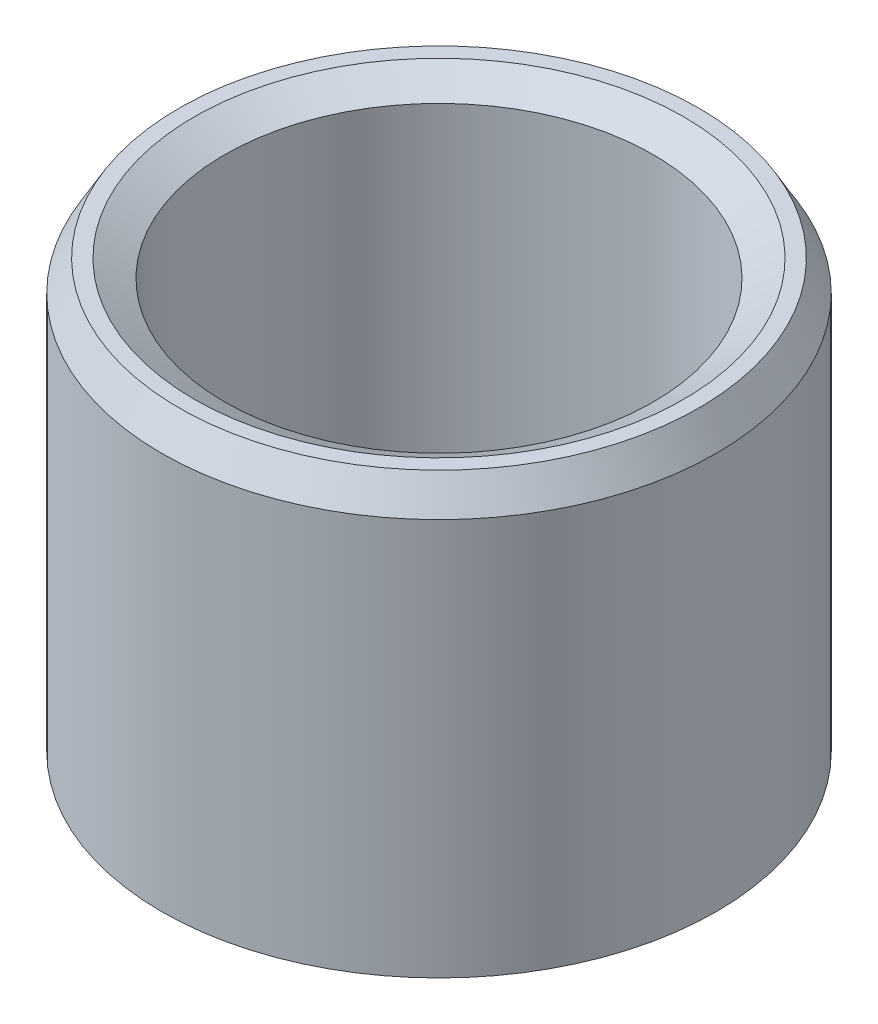
ISO-10303-21;
HEADER;
FILE_DESCRIPTION(('STEP AP214'),'2;1');
FILE_NAME('part.step','',(''),(''),'','','');
FILE_SCHEMA(('AUTOMOTIVE_DESIGN { 1 0 10303 214 1 1 1 1 }'));
ENDSEC;
DATA;
#1=APPLICATION_CONTEXT('core data for automotive mechanical design processes');
#2=APPLICATION_PROTOCOL_DEFINITION('international standard','automotive_design',2000,#1);
#3=PRODUCT_CONTEXT('',#1,'mechanical');
#4=PRODUCT('Part','Part','',(#3));
#5=PRODUCT_RELATED_PRODUCT_CATEGORY('part','',(#4));
#6=PRODUCT_DEFINITION_FORMATION('','',#4);
#7=PRODUCT_DEFINITION_CONTEXT('part definition',#1,'design');
#8=PRODUCT_DEFINITION('design','',#6,#7);
#9=PRODUCT_DEFINITION_SHAPE('','',#8);
#10=(LENGTH_UNIT() NAMED_UNIT(*) SI_UNIT(.MILLI.,.METRE.));
#11=(NAMED_UNIT(*) PLANE_ANGLE_UNIT() SI_UNIT($,.RADIAN.));
#12=(NAMED_UNIT(*) SI_UNIT($,.STERADIAN.) SOLID_ANGLE_UNIT());
#13=UNCERTAINTY_MEASURE_WITH_UNIT(LENGTH_MEASURE(1.E-05),#10,'distance_accuracy_value','');
#14=(GEOMETRIC_REPRESENTATION_CONTEXT(3) GLOBAL_UNCERTAINTY_ASSIGNED_CONTEXT((#13)) GLOBAL_UNIT_ASSIGNED_CONTEXT((#10,
#11,#12)) REPRESENTATION_CONTEXT('',''));
#15=CARTESIAN_POINT('',(0.,0.,0.));
#16=DIRECTION('',(0.,0.,1.));
#17=DIRECTION('',(1.,0.,0.));
#18=AXIS2_PLACEMENT_3D('',#15,#16,#17);
#19=CARTESIAN_POINT('',(0.,24.0608558800447,0.));
#20=DIRECTION('',(0.,-1.,0.));
#21=DIRECTION('',(0.,0.,-1.));
#22=AXIS2_PLACEMENT_3D('',#19,#20,#21);
#23=CYLINDRICAL_SURFACE('',#22,15.);
#24=CARTESIAN_POINT('',(0.,0.949940013277081,0.));
#25=DIRECTION('',(0.,1.,0.));
#26=DIRECTION('',(0.,0.,1.));
#27=AXIS2_PLACEMENT_3D('',#24,#25,#26);
#28=CIRCLE('',#27,15.);
#29=CARTESIAN_POINT('',(0.,0.949940013277081,15.));
#30=VERTEX_POINT('',#29);
#31=EDGE_CURVE('E10',#30,#30,#28,.T.);
#32=ORIENTED_EDGE('',*,*,#31,.T.);
#33=EDGE_LOOP('',(#32));
#34=FACE_BOUND('',#33,.T.);
#35=CARTESIAN_POINT('',(0.,22.4155115129062,0.));
#36=DIRECTION('',(0.,1.,0.));
#37=DIRECTION('',(0.,0.,1.));
#38=AXIS2_PLACEMENT_3D('',#35,#36,#37);
#39=CIRCLE('',#38,15.);
#40=CARTESIAN_POINT('',(0.,22.4155115129062,-15.));
#41=VERTEX_POINT('',#40);
#42=EDGE_CURVE('E50',#41,#41,#39,.F.);
#43=ORIENTED_EDGE('',*,*,#42,.T.);
#44=EDGE_LOOP('',(#43));
#45=FACE_BOUND('',#44,.T.);
#46=ADVANCED_FACE('F39',(#34,#45),#23,.T.);
#47=CARTESIAN_POINT('',(0.,24.0608558800447,0.));
#48=DIRECTION('',(0.,1.,0.));
#49=DIRECTION('',(0.,0.,1.));
#50=AXIS2_PLACEMENT_3D('',#47,#48,#49);
#51=PLANE('',#50);
#52=CARTESIAN_POINT('',(0.,24.0608558800447,0.));
#53=DIRECTION('',(0.,1.,0.));
#54=DIRECTION('',(0.,0.,1.));
#55=AXIS2_PLACEMENT_3D('',#52,#53,#54);
#56=CIRCLE('',#55,13.233890435164);
#57=CARTESIAN_POINT('',(0.,24.0608558800447,13.233890435164));
#58=VERTEX_POINT('',#57);
#59=EDGE_CURVE('E58',#58,#58,#56,.F.);
#60=ORIENTED_EDGE('',*,*,#59,.T.);
#61=EDGE_LOOP('',(#60));
#62=FACE_BOUND('',#61,.T.);
#63=CARTESIAN_POINT('',(0.,24.0608558800447,0.));
#64=DIRECTION('',(0.,1.,0.));
#65=DIRECTION('',(0.,0.,1.));
#66=AXIS2_PLACEMENT_3D('',#63,#64,#65);
#67=CIRCLE('',#66,14.0500599867229);
#68=CARTESIAN_POINT('',(0.,24.0608558800447,-14.0500599867229));
#69=VERTEX_POINT('',#68);
#70=EDGE_CURVE('E61',#69,#69,#67,.T.);
#71=ORIENTED_EDGE('',*,*,#70,.T.);
#72=EDGE_LOOP('',(#71));
#73=FACE_BOUND('',#72,.T.);
#74=ADVANCED_FACE('F88',(#62,#73),#51,.T.);
#75=CARTESIAN_POINT('',(0.,0.,0.));
#76=DIRECTION('',(0.,1.,0.));
#77=DIRECTION('',(0.,0.,1.));
#78=AXIS2_PLACEMENT_3D('',#75,#76,#77);
#79=PLANE('',#78);
#80=CARTESIAN_POINT('',(0.,0.,0.));
#81=DIRECTION('',(0.,1.,0.));
#82=DIRECTION('',(0.,0.,1.));
#83=AXIS2_PLACEMENT_3D('',#80,#81,#82);
#84=CIRCLE('',#83,12.5384860813025);
#85=CARTESIAN_POINT('',(0.,0.,12.5384860813025));
#86=VERTEX_POINT('',#85);
#87=EDGE_CURVE('E51',#86,#86,#84,.T.);
#88=ORIENTED_EDGE('',*,*,#87,.T.);
#89=EDGE_LOOP('',(#88));
#90=FACE_BOUND('',#89,.T.);
#91=CARTESIAN_POINT('',(0.,0.,0.));
#92=DIRECTION('',(0.,1.,0.));
#93=DIRECTION('',(0.,0.,1.));
#94=AXIS2_PLACEMENT_3D('',#91,#92,#93);
#95=CIRCLE('',#94,13.3546556328614);
#96=CARTESIAN_POINT('',(0.,0.,13.3546556328614));
#97=VERTEX_POINT('',#96);
#98=EDGE_CURVE('E54',#97,#97,#95,.F.);
#99=ORIENTED_EDGE('',*,*,#98,.T.);
#100=EDGE_LOOP('',(#99));
#101=FACE_BOUND('',#100,.T.);
#102=ADVANCED_FACE('F83',(#90,#101),#79,.F.);
#103=CARTESIAN_POINT('',(0.,24.0608558800447,0.));
#104=DIRECTION('',(0.,-1.,0.));
#105=DIRECTION('',(0.,0.,-1.));
#106=AXIS2_PLACEMENT_3D('',#103,#104,#105);
#107=CYLINDRICAL_SURFACE('',#106,11.5885460680254);
#108=CARTESIAN_POINT('',(0.,23.1109158667676,0.));
#109=DIRECTION('',(0.,1.,0.));
#110=DIRECTION('',(0.,0.,1.));
#111=AXIS2_PLACEMENT_3D('',#108,#109,#110);
#112=CIRCLE('',#111,11.5885460680254);
#113=CARTESIAN_POINT('',(0.,23.1109158667676,11.5885460680254));
#114=VERTEX_POINT('',#113);
#115=EDGE_CURVE('E67',#114,#114,#112,.T.);
#116=ORIENTED_EDGE('',*,*,#115,.T.);
#117=EDGE_LOOP('',(#116));
#118=FACE_BOUND('',#117,.T.);
#119=CARTESIAN_POINT('',(0.,1.64534436713857,0.));
#120=DIRECTION('',(0.,1.,0.));
#121=DIRECTION('',(0.,0.,1.));
#122=AXIS2_PLACEMENT_3D('',#119,#120,#121);
#123=CIRCLE('',#122,11.5885460680254);
#124=CARTESIAN_POINT('',(0.,1.64534436713857,11.5885460680254));
#125=VERTEX_POINT('',#124);
#126=EDGE_CURVE('E69',#125,#125,#123,.F.);
#127=ORIENTED_EDGE('',*,*,#126,.T.);
#128=EDGE_LOOP('',(#127));
#129=FACE_BOUND('',#128,.T.);
#130=ADVANCED_FACE('F71',(#118,#129),#107,.F.);
#131=CARTESIAN_POINT('',(0.,23.1109158667676,0.));
#132=DIRECTION('',(0.,1.,0.));
#133=DIRECTION('',(0.,0.,1.));
#134=AXIS2_PLACEMENT_3D('',#131,#132,#133);
#135=CONICAL_SURFACE('',#134,11.5885460680254,1.0471975511966);
#136=CARTESIAN_POINT('',(0.,24.0608558800447,13.233890435164));
#137=CARTESIAN_POINT('',(0.,24.0509606715731,13.2167514313396));
#138=CARTESIAN_POINT('',(0.,24.0410654631014,13.1996124275153));
#139=CARTESIAN_POINT('',(0.,24.0212750461582,13.1653344198666));
#140=CARTESIAN_POINT('',(0.,24.0113798376865,13.1481954160422));
#141=CARTESIAN_POINT('',(0.,23.9915894207433,13.1139174083935));
#142=CARTESIAN_POINT('',(0.,23.9816942122716,13.0967784045691));
#143=CARTESIAN_POINT('',(0.,23.9619037953284,13.0625003969204));
#144=CARTESIAN_POINT('',(0.,23.9520085868567,13.045361393096));
#145=CARTESIAN_POINT('',(0.,23.9322181699135,13.0110833854473));
#146=CARTESIAN_POINT('',(0.,23.9223229614418,12.993944381623));
#147=CARTESIAN_POINT('',(0.,23.9025325444985,12.9596663739742));
#148=CARTESIAN_POINT('',(0.,23.8926373360269,12.9425273701499));
#149=CARTESIAN_POINT('',(0.,23.8728469190836,12.9082493625012));
#150=CARTESIAN_POINT('',(0.,23.862951710612,12.8911103586768));
#151=CARTESIAN_POINT('',(0.,23.8431612936687,12.8568323510281));
#152=CARTESIAN_POINT('',(0.,23.8332660851971,12.8396933472037));
#153=CARTESIAN_POINT('',(0.,23.8134756682538,12.805415339555));
#154=CARTESIAN_POINT('',(0.,23.8035804597822,12.7882763357306));
#155=CARTESIAN_POINT('',(0.,23.7837900428389,12.7539983280819));
#156=CARTESIAN_POINT('',(0.,23.7738948343673,12.7368593242576));
#157=CARTESIAN_POINT('',(0.,23.754104417424,12.7025813166088));
#158=CARTESIAN_POINT('',(0.,23.7442092089524,12.6854423127845));
#159=CARTESIAN_POINT('',(0.,23.7244187920091,12.6511643051358));
#160=CARTESIAN_POINT('',(0.,23.7145235835375,12.6340253013114));
#161=CARTESIAN_POINT('',(0.,23.6947331665942,12.5997472936627));
#162=CARTESIAN_POINT('',(0.,23.6848379581225,12.5826082898383));
#163=CARTESIAN_POINT('',(0.,23.6650475411793,12.5483302821896));
#164=CARTESIAN_POINT('',(0.,23.6551523327076,12.5311912783652));
#165=CARTESIAN_POINT('',(0.,23.6353619157644,12.4969132707165));
#166=CARTESIAN_POINT('',(0.,23.6254667072927,12.4797742668922));
#167=CARTESIAN_POINT('',(0.,23.6056762903495,12.4454962592434));
#168=CARTESIAN_POINT('',(0.,23.5957810818778,12.4283572554191));
#169=CARTESIAN_POINT('',(0.,23.5759906649345,12.3940792477704));
#170=CARTESIAN_POINT('',(0.,23.5660954564629,12.376940243946));
#171=CARTESIAN_POINT('',(0.,23.5463050395196,12.3426622362973));
#172=CARTESIAN_POINT('',(0.,23.536409831048,12.3255232324729));
#173=CARTESIAN_POINT('',(0.,23.5166194141047,12.2912452248242));
#174=CARTESIAN_POINT('',(0.,23.5067242056331,12.2741062209998));
#175=CARTESIAN_POINT('',(0.,23.4869337886898,12.2398282133511));
#176=CARTESIAN_POINT('',(0.,23.4770385802182,12.2226892095268));
#177=CARTESIAN_POINT('',(0.,23.4572481632749,12.188411201878));
#178=CARTESIAN_POINT('',(0.,23.4473529548033,12.1712721980537));
#179=CARTESIAN_POINT('',(0.,23.42756253786,12.136994190405));
#180=CARTESIAN_POINT('',(0.,23.4176673293884,12.1198551865806));
#181=CARTESIAN_POINT('',(0.,23.3978769124451,12.0855771789319));
#182=CARTESIAN_POINT('',(0.,23.3879817039735,12.0684381751075));
#183=CARTESIAN_POINT('',(0.,23.3681912870302,12.0341601674588));
#184=CARTESIAN_POINT('',(0.,23.3582960785585,12.0170211636344));
#185=CARTESIAN_POINT('',(0.,23.3385056616153,11.9827431559857));
#186=CARTESIAN_POINT('',(0.,23.3286104531436,11.9656041521614));
#187=CARTESIAN_POINT('',(0.,23.3088200362004,11.9313261445126));
#188=CARTESIAN_POINT('',(0.,23.2989248277287,11.9141871406883));
#189=CARTESIAN_POINT('',(0.,23.2791344107855,11.8799091330396));
#190=CARTESIAN_POINT('',(0.,23.2692392023138,11.8627701292152));
#191=CARTESIAN_POINT('',(0.,23.2494487853706,11.8284921215665));
#192=CARTESIAN_POINT('',(0.,23.2395535768989,11.8113531177421));
#193=CARTESIAN_POINT('',(0.,23.2197631599556,11.7770751100934));
#194=CARTESIAN_POINT('',(0.,23.209867951484,11.759936106269));
#195=CARTESIAN_POINT('',(0.,23.1900775345407,11.7256580986203));
#196=CARTESIAN_POINT('',(0.,23.1801823260691,11.708519094796));
#197=CARTESIAN_POINT('',(0.,23.1603919091258,11.6742410871472));
#198=CARTESIAN_POINT('',(0.,23.1504967006542,11.6571020833229));
#199=CARTESIAN_POINT('',(0.,23.1307062837109,11.6228240756742));
#200=CARTESIAN_POINT('',(0.,23.1208110752393,11.6056850718498));
#201=CARTESIAN_POINT('',(0.,23.1109158667676,11.5885460680254));
#202=B_SPLINE_CURVE_WITH_KNOTS('',3,(#136,#137,#138,#139,#140,#141,#142,#143,#144,#145,#146,
#147,#148,#149,#150,#151,#152,#153,#154,#155,#156,#157,#158,#159,#160,#161,#162,#163,#164,#165,
#166,#167,#168,#169,#170,#171,#172,#173,#174,#175,#176,#177,#178,#179,#180,#181,#182,#183,#184,
#185,#186,#187,#188,#189,#190,#191,#192,#193,#194,#195,#196,#197,#198,#199,#200,#201),
.UNSPECIFIED.,.F.,.F.,(4,2,2,2,2,2,2,2,2,2,2,2,2,2,2,2,2,2,2,2,2,2,2,2,2,2,2,2,2,2,2,2,4),(0.,
0.059371250829817,0.118742501659634,0.178113752489452,0.237485003319269,0.296856254149088,
0.356227504978905,0.415598755808723,0.47497000663854,0.534341257468357,0.593712508298176,
0.653083759127991,0.71245500995781,0.771826260787627,0.831197511617445,0.890568762447262,
0.949940013277081,1.0093112641069,1.06868251493672,1.12805376576653,1.18742501659635,
1.24679626742617,1.30616751825598,1.3655387690858,1.42491001991562,1.48428127074544,
1.54365252157525,1.60302377240507,1.66239502323489,1.72176627406471,1.78113752489452,
1.84050877572434,1.89988002655416),.UNSPECIFIED.);
#203=EDGE_CURVE('BSEAM77',#58,#114,#202,.T.);
#204=ORIENTED_EDGE('',*,*,#59,.F.);
#205=ORIENTED_EDGE('',*,*,#115,.F.);
#206=ORIENTED_EDGE('',*,*,#203,.T.);
#207=ORIENTED_EDGE('',*,*,#203,.F.);
#208=EDGE_LOOP('',(#204,#206,#205,#207));
#209=FACE_BOUND('',#208,.T.);
#210=ADVANCED_FACE('F77',(#209),#135,.F.);
#211=CARTESIAN_POINT('',(0.,0.,0.));
#212=DIRECTION('',(0.,-1.,0.));
#213=DIRECTION('',(0.,0.,-1.));
#214=AXIS2_PLACEMENT_3D('',#211,#212,#213);
#215=CONICAL_SURFACE('',#214,12.5384860813025,0.523598775598295);
#216=ORIENTED_EDGE('',*,*,#126,.F.);
#217=EDGE_LOOP('',(#216));
#218=FACE_BOUND('',#217,.T.);
#219=ORIENTED_EDGE('',*,*,#87,.F.);
#220=EDGE_LOOP('',(#219));
#221=FACE_BOUND('',#220,.T.);
#222=ADVANCED_FACE('F73',(#218,#221),#215,.F.);
#223=CARTESIAN_POINT('',(0.,0.949940013277081,0.));
#224=DIRECTION('',(0.,1.,0.));
#225=DIRECTION('',(0.,0.,1.));
#226=AXIS2_PLACEMENT_3D('',#223,#224,#225);
#227=CONICAL_SURFACE('',#226,15.,1.0471975511966);
#228=ORIENTED_EDGE('',*,*,#98,.F.);
#229=EDGE_LOOP('',(#228));
#230=FACE_BOUND('',#229,.T.);
#231=ORIENTED_EDGE('',*,*,#31,.F.);
#232=EDGE_LOOP('',(#231));
#233=FACE_BOUND('',#232,.T.);
#234=ADVANCED_FACE('F76',(#230,#233),#227,.T.);
#235=CARTESIAN_POINT('',(0.,24.0608558800447,0.));
#236=DIRECTION('',(0.,-1.,0.));
#237=DIRECTION('',(0.,0.,-1.));
#238=AXIS2_PLACEMENT_3D('',#235,#236,#237);
#239=CONICAL_SURFACE('',#238,14.0500599867229,0.523598775598297);
#240=CARTESIAN_POINT('',(0.,22.4155115129062,-15.));
#241=CARTESIAN_POINT('',(0.,22.4326505167305,-14.9901047915284));
#242=CARTESIAN_POINT('',(0.,22.4497895205549,-14.9802095830567));
#243=CARTESIAN_POINT('',(0.,22.4840675282036,-14.9604191661135));
#244=CARTESIAN_POINT('',(0.,22.501206532028,-14.9505239576418));
#245=CARTESIAN_POINT('',(0.,22.5354845396767,-14.9307335406985));
#246=CARTESIAN_POINT('',(0.,22.552623543501,-14.9208383322269));
#247=CARTESIAN_POINT('',(0.,22.5869015511498,-14.9010479152836));
#248=CARTESIAN_POINT('',(0.,22.6040405549741,-14.891152706812));
#249=CARTESIAN_POINT('',(0.,22.6383185626228,-14.8713622898687));
#250=CARTESIAN_POINT('',(0.,22.6554575664472,-14.8614670813971));
#251=CARTESIAN_POINT('',(0.,22.6897355740959,-14.8416766644538));
#252=CARTESIAN_POINT('',(0.,22.7068745779203,-14.8317814559822));
#253=CARTESIAN_POINT('',(0.,22.741152585569,-14.8119910390389));
#254=CARTESIAN_POINT('',(0.,22.7582915893934,-14.8020958305673));
#255=CARTESIAN_POINT('',(0.,22.7925695970421,-14.782305413624));
#256=CARTESIAN_POINT('',(0.,22.8097086008664,-14.7724102051524));
#257=CARTESIAN_POINT('',(0.,22.8439866085152,-14.7526197882091));
#258=CARTESIAN_POINT('',(0.,22.8611256123395,-14.7427245797375));
#259=CARTESIAN_POINT('',(0.,22.8954036199882,-14.7229341627942));
#260=CARTESIAN_POINT('',(0.,22.9125426238126,-14.7130389543226));
#261=CARTESIAN_POINT('',(0.,22.9468206314613,-14.6932485373793));
#262=CARTESIAN_POINT('',(0.,22.9639596352857,-14.6833533289076));
#263=CARTESIAN_POINT('',(0.,22.9982376429344,-14.6635629119644));
#264=CARTESIAN_POINT('',(0.,23.0153766467588,-14.6536677034927));
#265=CARTESIAN_POINT('',(0.,23.0496546544075,-14.6338772865495));
#266=CARTESIAN_POINT('',(0.,23.0667936582318,-14.6239820780778));
#267=CARTESIAN_POINT('',(0.,23.1010716658806,-14.6041916611345));
#268=CARTESIAN_POINT('',(0.,23.1182106697049,-14.5942964526629));
#269=CARTESIAN_POINT('',(0.,23.1524886773536,-14.5745060357196));
#270=CARTESIAN_POINT('',(0.,23.169627681178,-14.564610827248));
#271=CARTESIAN_POINT('',(0.,23.2039056888267,-14.5448204103047));
#272=CARTESIAN_POINT('',(0.,23.2210446926511,-14.5349252018331));
#273=CARTESIAN_POINT('',(0.,23.2553227002998,-14.5151347848898));
#274=CARTESIAN_POINT('',(0.,23.2724617041242,-14.5052395764182));
#275=CARTESIAN_POINT('',(0.,23.3067397117729,-14.4854491594749));
#276=CARTESIAN_POINT('',(0.,23.3238787155972,-14.4755539510033));
#277=CARTESIAN_POINT('',(0.,23.358156723246,-14.45576353406));
#278=CARTESIAN_POINT('',(0.,23.3752957270703,-14.4458683255884));
#279=CARTESIAN_POINT('',(0.,23.409573734719,-14.4260779086451));
#280=CARTESIAN_POINT('',(0.,23.4267127385434,-14.4161827001735));
#281=CARTESIAN_POINT('',(0.,23.4609907461921,-14.3963922832302));
#282=CARTESIAN_POINT('',(0.,23.4781297500165,-14.3864970747586));
#283=CARTESIAN_POINT('',(0.,23.5124077576652,-14.3667066578153));
#284=CARTESIAN_POINT('',(0.,23.5295467614896,-14.3568114493436));
#285=CARTESIAN_POINT('',(0.,23.5638247691383,-14.3370210324004));
#286=CARTESIAN_POINT('',(0.,23.5809637729626,-14.3271258239287));
#287=CARTESIAN_POINT('',(0.,23.6152417806114,-14.3073354069855));
#288=CARTESIAN_POINT('',(0.,23.6323807844357,-14.2974401985138));
#289=CARTESIAN_POINT('',(0.,23.6666587920844,-14.2776497815706));
#290=CARTESIAN_POINT('',(0.,23.6837977959088,-14.2677545730989));
#291=CARTESIAN_POINT('',(0.,23.7180758035575,-14.2479641561556));
#292=CARTESIAN_POINT('',(0.,23.7352148073819,-14.238068947684));
#293=CARTESIAN_POINT('',(0.,23.7694928150306,-14.2182785307407));
#294=CARTESIAN_POINT('',(0.,23.786631818855,-14.2083833222691));
#295=CARTESIAN_POINT('',(0.,23.8209098265037,-14.1885929053258));
#296=CARTESIAN_POINT('',(0.,23.838048830328,-14.1786976968542));
#297=CARTESIAN_POINT('',(0.,23.8723268379768,-14.1589072799109));
#298=CARTESIAN_POINT('',(0.,23.8894658418011,-14.1490120714393));
#299=CARTESIAN_POINT('',(0.,23.9237438494498,-14.129221654496));
#300=CARTESIAN_POINT('',(0.,23.9408828532742,-14.1193264460244));
#301=CARTESIAN_POINT('',(0.,23.9751608609229,-14.0995360290811));
#302=CARTESIAN_POINT('',(0.,23.9922998647473,-14.0896408206095));
#303=CARTESIAN_POINT('',(0.,24.026577872396,-14.0698504036662));
#304=CARTESIAN_POINT('',(0.,24.0437168762204,-14.0599551951946));
#305=CARTESIAN_POINT('',(0.,24.0608558800447,-14.0500599867229));
#306=B_SPLINE_CURVE_WITH_KNOTS('',3,(#240,#241,#242,#243,#244,#245,#246,#247,#248,#249,#250,
#251,#252,#253,#254,#255,#256,#257,#258,#259,#260,#261,#262,#263,#264,#265,#266,#267,#268,#269,
#270,#271,#272,#273,#274,#275,#276,#277,#278,#279,#280,#281,#282,#283,#284,#285,#286,#287,#288,
#289,#290,#291,#292,#293,#294,#295,#296,#297,#298,#299,#300,#301,#302,#303,#304,#305),
.UNSPECIFIED.,.F.,.F.,(4,2,2,2,2,2,2,2,2,2,2,2,2,2,2,2,2,2,2,2,2,2,2,2,2,2,2,2,2,2,2,2,4),(0.,
0.0593712508298185,0.118742501659637,0.178113752489455,0.237485003319271,0.296856254149089,
0.356227504978908,0.415598755808722,0.474970006638541,0.534341257468359,0.593712508298178,
0.653083759127993,0.712455009957812,0.77182626078763,0.831197511617449,0.890568762447264,
0.949940013277082,1.0093112641069,1.06868251493672,1.12805376576653,1.18742501659635,
1.24679626742617,1.30616751825599,1.36553876908581,1.42491001991562,1.48428127074544,
1.54365252157526,1.60302377240508,1.66239502323489,1.72176627406471,1.78113752489453,
1.84050877572435,1.89988002655416),.UNSPECIFIED.);
#307=EDGE_CURVE('BSEAM45',#41,#69,#306,.T.);
#308=ORIENTED_EDGE('',*,*,#42,.F.);
#309=ORIENTED_EDGE('',*,*,#70,.F.);
#310=ORIENTED_EDGE('',*,*,#307,.T.);
#311=ORIENTED_EDGE('',*,*,#307,.F.);
#312=EDGE_LOOP('',(#308,#310,#309,#311));
#313=FACE_BOUND('',#312,.T.);
#314=ADVANCED_FACE('F45',(#313),#239,.T.);
#315=CLOSED_SHELL('',(#46,#74,#102,#130,#210,#222,#234,#314));
#316=MANIFOLD_SOLID_BREP('B2',#315);
#317=ADVANCED_BREP_SHAPE_REPRESENTATION('',(#18,#316),#14);
#318=SHAPE_DEFINITION_REPRESENTATION(#9,#317);
ENDSEC;
END-ISO-10303-21;
